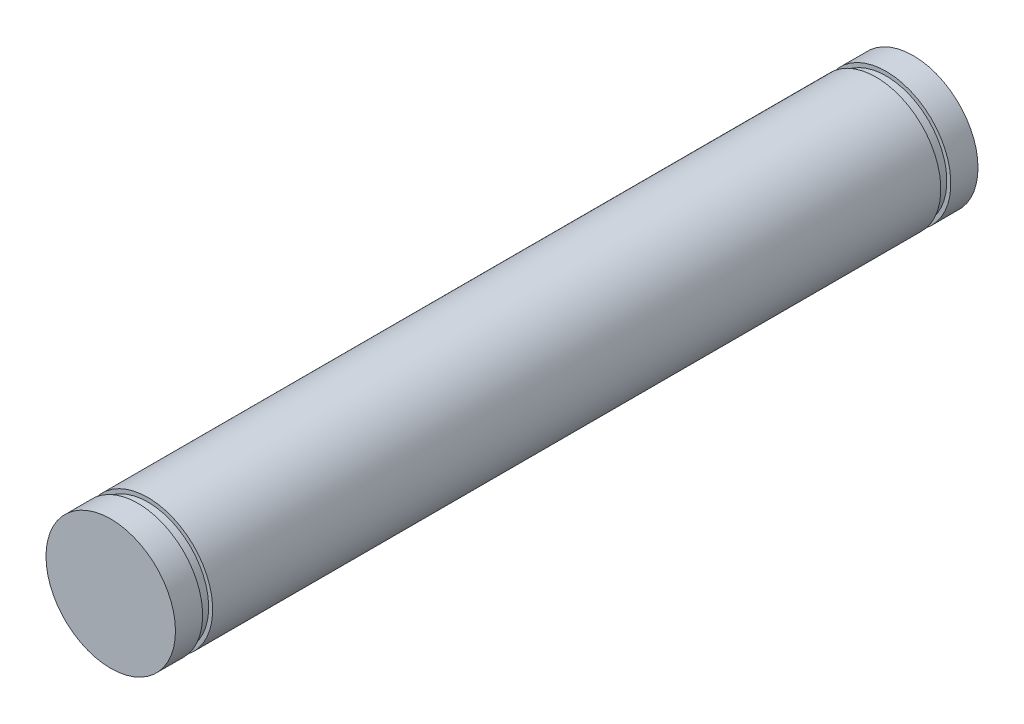
ISO-10303-21;
HEADER;
FILE_DESCRIPTION(('STEP AP214'),'2;1');
FILE_NAME('part.step','',(''),(''),'','','');
FILE_SCHEMA(('AUTOMOTIVE_DESIGN { 1 0 10303 214 1 1 1 1 }'));
ENDSEC;
DATA;
#1=APPLICATION_CONTEXT('core data for automotive mechanical design processes');
#2=APPLICATION_PROTOCOL_DEFINITION('international standard','automotive_design',2000,#1);
#3=PRODUCT_CONTEXT('',#1,'mechanical');
#4=PRODUCT('Part','Part','',(#3));
#5=PRODUCT_RELATED_PRODUCT_CATEGORY('part','',(#4));
#6=PRODUCT_DEFINITION_FORMATION('','',#4);
#7=PRODUCT_DEFINITION_CONTEXT('part definition',#1,'design');
#8=PRODUCT_DEFINITION('design','',#6,#7);
#9=PRODUCT_DEFINITION_SHAPE('','',#8);
#10=(LENGTH_UNIT() NAMED_UNIT(*) SI_UNIT(.MILLI.,.METRE.));
#11=(NAMED_UNIT(*) PLANE_ANGLE_UNIT() SI_UNIT($,.RADIAN.));
#12=(NAMED_UNIT(*) SI_UNIT($,.STERADIAN.) SOLID_ANGLE_UNIT());
#13=UNCERTAINTY_MEASURE_WITH_UNIT(LENGTH_MEASURE(1.E-05),#10,'distance_accuracy_value','');
#14=(GEOMETRIC_REPRESENTATION_CONTEXT(3) GLOBAL_UNCERTAINTY_ASSIGNED_CONTEXT((#13)) GLOBAL_UNIT_ASSIGNED_CONTEXT((#10,
#11,#12)) REPRESENTATION_CONTEXT('',''));
#15=CARTESIAN_POINT('',(0.,0.,0.));
#16=DIRECTION('',(0.,0.,1.));
#17=DIRECTION('',(1.,0.,0.));
#18=AXIS2_PLACEMENT_3D('',#15,#16,#17);
#19=CARTESIAN_POINT('',(0.,0.,59.05));
#20=DIRECTION('',(0.,0.,-1.));
#21=DIRECTION('',(-1.,0.,0.));
#22=AXIS2_PLACEMENT_3D('',#19,#20,#21);
#23=CYLINDRICAL_SURFACE('',#22,4.7625);
#24=CARTESIAN_POINT('',(0.,0.,2.));
#25=DIRECTION('',(0.,0.,-1.));
#26=DIRECTION('',(-1.,0.,0.));
#27=AXIS2_PLACEMENT_3D('',#24,#25,#26);
#28=CIRCLE('',#27,4.7625);
#29=CARTESIAN_POINT('',(-4.7625,0.,2.));
#30=VERTEX_POINT('',#29);
#31=EDGE_CURVE('E56',#30,#30,#28,.T.);
#32=ORIENTED_EDGE('',*,*,#31,.T.);
#33=EDGE_LOOP('',(#32));
#34=FACE_BOUND('',#33,.T.);
#35=CARTESIAN_POINT('',(0.,0.,0.));
#36=DIRECTION('',(0.,0.,1.));
#37=DIRECTION('',(1.,0.,0.));
#38=AXIS2_PLACEMENT_3D('',#35,#36,#37);
#39=CIRCLE('',#38,4.7625);
#40=CARTESIAN_POINT('',(4.7625,0.,0.));
#41=VERTEX_POINT('',#40);
#42=EDGE_CURVE('E49',#41,#41,#39,.T.);
#43=ORIENTED_EDGE('',*,*,#42,.T.);
#44=EDGE_LOOP('',(#43));
#45=FACE_BOUND('',#44,.T.);
#46=ADVANCED_FACE('F45',(#34,#45),#23,.T.);
#47=CARTESIAN_POINT('',(0.,0.,0.));
#48=DIRECTION('',(0.,0.,1.));
#49=DIRECTION('',(1.,0.,0.));
#50=AXIS2_PLACEMENT_3D('',#47,#48,#49);
#51=PLANE('',#50);
#52=ORIENTED_EDGE('',*,*,#42,.F.);
#53=EDGE_LOOP('',(#52));
#54=FACE_BOUND('',#53,.T.);
#55=ADVANCED_FACE('F115',(#54),#51,.F.);
#56=CARTESIAN_POINT('',(-4.7625,0.,2.));
#57=DIRECTION('',(0.,0.,-1.));
#58=DIRECTION('',(-1.,0.,0.));
#59=AXIS2_PLACEMENT_3D('',#56,#57,#58);
#60=PLANE('',#59);
#61=ORIENTED_EDGE('',*,*,#31,.F.);
#62=EDGE_LOOP('',(#61));
#63=FACE_BOUND('',#62,.T.);
#64=CARTESIAN_POINT('',(0.,0.,2.));
#65=DIRECTION('',(0.,0.,-1.));
#66=DIRECTION('',(-1.,0.,0.));
#67=AXIS2_PLACEMENT_3D('',#64,#65,#66);
#68=CIRCLE('',#67,4.4704);
#69=CARTESIAN_POINT('',(-4.4704,0.,2.));
#70=VERTEX_POINT('',#69);
#71=EDGE_CURVE('E73',#70,#70,#68,.T.);
#72=ORIENTED_EDGE('',*,*,#71,.T.);
#73=EDGE_LOOP('',(#72));
#74=FACE_BOUND('',#73,.T.);
#75=ADVANCED_FACE('F121',(#63,#74),#60,.F.);
#76=CARTESIAN_POINT('',(0.,0.,0.));
#77=DIRECTION('',(0.,0.,-1.));
#78=DIRECTION('',(-1.,0.,0.));
#79=AXIS2_PLACEMENT_3D('',#76,#77,#78);
#80=CYLINDRICAL_SURFACE('',#79,4.4704);
#81=ORIENTED_EDGE('',*,*,#71,.F.);
#82=EDGE_LOOP('',(#81));
#83=FACE_BOUND('',#82,.T.);
#84=CARTESIAN_POINT('',(0.,0.,2.7366));
#85=DIRECTION('',(0.,0.,-1.));
#86=DIRECTION('',(-1.,0.,0.));
#87=AXIS2_PLACEMENT_3D('',#84,#85,#86);
#88=CIRCLE('',#87,4.4704);
#89=CARTESIAN_POINT('',(-4.4704,0.,2.7366));
#90=VERTEX_POINT('',#89);
#91=EDGE_CURVE('E76',#90,#90,#88,.T.);
#92=ORIENTED_EDGE('',*,*,#91,.T.);
#93=EDGE_LOOP('',(#92));
#94=FACE_BOUND('',#93,.T.);
#95=ADVANCED_FACE('F128',(#83,#94),#80,.T.);
#96=CARTESIAN_POINT('',(-4.4704,0.,2.7366));
#97=DIRECTION('',(0.,0.,1.));
#98=DIRECTION('',(1.,0.,0.));
#99=AXIS2_PLACEMENT_3D('',#96,#97,#98);
#100=PLANE('',#99);
#101=ORIENTED_EDGE('',*,*,#91,.F.);
#102=EDGE_LOOP('',(#101));
#103=FACE_BOUND('',#102,.T.);
#104=CARTESIAN_POINT('',(0.,0.,2.7366));
#105=DIRECTION('',(0.,0.,-1.));
#106=DIRECTION('',(-1.,0.,0.));
#107=AXIS2_PLACEMENT_3D('',#104,#105,#106);
#108=CIRCLE('',#107,4.7625);
#109=CARTESIAN_POINT('',(-4.7625,0.,2.7366));
#110=VERTEX_POINT('',#109);
#111=EDGE_CURVE('E61',#110,#110,#108,.T.);
#112=ORIENTED_EDGE('',*,*,#111,.T.);
#113=EDGE_LOOP('',(#112));
#114=FACE_BOUND('',#113,.T.);
#115=ADVANCED_FACE('F82',(#103,#114),#100,.F.);
#116=ORIENTED_EDGE('',*,*,#111,.F.);
#117=EDGE_LOOP('',(#116));
#118=FACE_BOUND('',#117,.T.);
#119=CARTESIAN_POINT('',(0.,0.,56.3134));
#120=DIRECTION('',(0.,0.,-1.));
#121=DIRECTION('',(-1.,0.,0.));
#122=AXIS2_PLACEMENT_3D('',#119,#120,#121);
#123=CIRCLE('',#122,4.7625);
#124=CARTESIAN_POINT('',(-4.7625,0.,56.3134));
#125=VERTEX_POINT('',#124);
#126=EDGE_CURVE('E62',#125,#125,#123,.T.);
#127=ORIENTED_EDGE('',*,*,#126,.T.);
#128=EDGE_LOOP('',(#127));
#129=FACE_BOUND('',#128,.T.);
#130=ADVANCED_FACE('F84',(#118,#129),#23,.T.);
#131=CARTESIAN_POINT('',(0.,0.,0.));
#132=DIRECTION('',(0.,0.,-1.));
#133=DIRECTION('',(-1.,0.,0.));
#134=AXIS2_PLACEMENT_3D('',#131,#132,#133);
#135=CYLINDRICAL_SURFACE('',#134,4.47039999999999);
#136=CARTESIAN_POINT('',(0.,0.,56.3134));
#137=DIRECTION('',(0.,0.,-1.));
#138=DIRECTION('',(-1.,0.,0.));
#139=AXIS2_PLACEMENT_3D('',#136,#137,#138);
#140=CIRCLE('',#139,4.47039999999999);
#141=CARTESIAN_POINT('',(-4.47039999999999,0.,56.3134));
#142=VERTEX_POINT('',#141);
#143=EDGE_CURVE('E58',#142,#142,#140,.T.);
#144=ORIENTED_EDGE('',*,*,#143,.F.);
#145=EDGE_LOOP('',(#144));
#146=FACE_BOUND('',#145,.T.);
#147=CARTESIAN_POINT('',(0.,0.,57.05));
#148=DIRECTION('',(0.,0.,-1.));
#149=DIRECTION('',(-1.,0.,0.));
#150=AXIS2_PLACEMENT_3D('',#147,#148,#149);
#151=CIRCLE('',#150,4.47039999999999);
#152=CARTESIAN_POINT('',(-4.47039999999999,0.,57.05));
#153=VERTEX_POINT('',#152);
#154=EDGE_CURVE('E68',#153,#153,#151,.T.);
#155=ORIENTED_EDGE('',*,*,#154,.T.);
#156=EDGE_LOOP('',(#155));
#157=FACE_BOUND('',#156,.T.);
#158=ADVANCED_FACE('F87',(#146,#157),#135,.T.);
#159=CARTESIAN_POINT('',(-4.47039999999999,0.,56.3134));
#160=DIRECTION('',(0.,0.,-1.));
#161=DIRECTION('',(-1.,0.,0.));
#162=AXIS2_PLACEMENT_3D('',#159,#160,#161);
#163=PLANE('',#162);
#164=ORIENTED_EDGE('',*,*,#126,.F.);
#165=EDGE_LOOP('',(#164));
#166=FACE_BOUND('',#165,.T.);
#167=ORIENTED_EDGE('',*,*,#143,.T.);
#168=EDGE_LOOP('',(#167));
#169=FACE_BOUND('',#168,.T.);
#170=ADVANCED_FACE('F90',(#166,#169),#163,.F.);
#171=CARTESIAN_POINT('',(-4.7625,0.,57.05));
#172=DIRECTION('',(0.,0.,1.));
#173=DIRECTION('',(1.,0.,0.));
#174=AXIS2_PLACEMENT_3D('',#171,#172,#173);
#175=PLANE('',#174);
#176=ORIENTED_EDGE('',*,*,#154,.F.);
#177=EDGE_LOOP('',(#176));
#178=FACE_BOUND('',#177,.T.);
#179=CARTESIAN_POINT('',(0.,0.,57.05));
#180=DIRECTION('',(0.,0.,-1.));
#181=DIRECTION('',(-1.,0.,0.));
#182=AXIS2_PLACEMENT_3D('',#179,#180,#181);
#183=CIRCLE('',#182,4.7625);
#184=CARTESIAN_POINT('',(-4.7625,0.,57.05));
#185=VERTEX_POINT('',#184);
#186=EDGE_CURVE('E65',#185,#185,#183,.T.);
#187=ORIENTED_EDGE('',*,*,#186,.T.);
#188=EDGE_LOOP('',(#187));
#189=FACE_BOUND('',#188,.T.);
#190=ADVANCED_FACE('F93',(#178,#189),#175,.F.);
#191=CARTESIAN_POINT('',(0.,0.,59.05));
#192=DIRECTION('',(0.,0.,1.));
#193=DIRECTION('',(1.,0.,0.));
#194=AXIS2_PLACEMENT_3D('',#191,#192,#193);
#195=PLANE('',#194);
#196=CARTESIAN_POINT('',(0.,0.,59.05));
#197=DIRECTION('',(0.,0.,1.));
#198=DIRECTION('',(1.,0.,0.));
#199=AXIS2_PLACEMENT_3D('',#196,#197,#198);
#200=CIRCLE('',#199,4.7625);
#201=CARTESIAN_POINT('',(4.7625,0.,59.05));
#202=VERTEX_POINT('',#201);
#203=EDGE_CURVE('E10',#202,#202,#200,.T.);
#204=ORIENTED_EDGE('',*,*,#203,.T.);
#205=EDGE_LOOP('',(#204));
#206=FACE_BOUND('',#205,.T.);
#207=ADVANCED_FACE('F104',(#206),#195,.T.);
#208=ORIENTED_EDGE('',*,*,#186,.F.);
#209=EDGE_LOOP('',(#208));
#210=FACE_BOUND('',#209,.T.);
#211=ORIENTED_EDGE('',*,*,#203,.F.);
#212=EDGE_LOOP('',(#211));
#213=FACE_BOUND('',#212,.T.);
#214=ADVANCED_FACE('F47',(#210,#213),#23,.T.);
#215=CLOSED_SHELL('',(#46,#55,#75,#95,#115,#130,#158,#170,#190,#207,#214));
#216=MANIFOLD_SOLID_BREP('B2',#215);
#217=ADVANCED_BREP_SHAPE_REPRESENTATION('',(#18,#216),#14);
#218=SHAPE_DEFINITION_REPRESENTATION(#9,#217);
ENDSEC;
END-ISO-10303-21;
